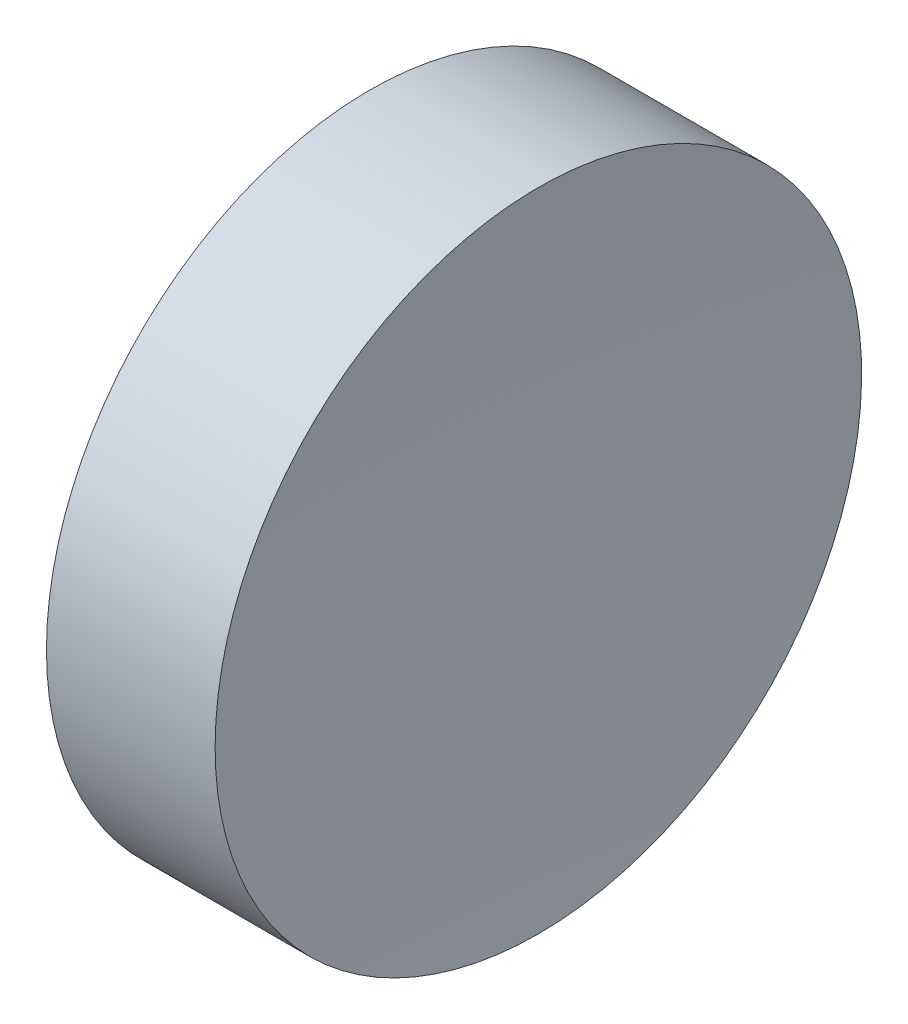
ISO-10303-21;
HEADER;
FILE_DESCRIPTION(('STEP AP214'),'2;1');
FILE_NAME('part.step','',(''),(''),'','','');
FILE_SCHEMA(('AUTOMOTIVE_DESIGN { 1 0 10303 214 1 1 1 1 }'));
ENDSEC;
DATA;
#1=APPLICATION_CONTEXT('core data for automotive mechanical design processes');
#2=APPLICATION_PROTOCOL_DEFINITION('international standard','automotive_design',2000,#1);
#3=PRODUCT_CONTEXT('',#1,'mechanical');
#4=PRODUCT('Part','Part','',(#3));
#5=PRODUCT_RELATED_PRODUCT_CATEGORY('part','',(#4));
#6=PRODUCT_DEFINITION_FORMATION('','',#4);
#7=PRODUCT_DEFINITION_CONTEXT('part definition',#1,'design');
#8=PRODUCT_DEFINITION('design','',#6,#7);
#9=PRODUCT_DEFINITION_SHAPE('','',#8);
#10=(LENGTH_UNIT() NAMED_UNIT(*) SI_UNIT(.MILLI.,.METRE.));
#11=(NAMED_UNIT(*) PLANE_ANGLE_UNIT() SI_UNIT($,.RADIAN.));
#12=(NAMED_UNIT(*) SI_UNIT($,.STERADIAN.) SOLID_ANGLE_UNIT());
#13=UNCERTAINTY_MEASURE_WITH_UNIT(LENGTH_MEASURE(1.E-05),#10,'distance_accuracy_value','');
#14=(GEOMETRIC_REPRESENTATION_CONTEXT(3) GLOBAL_UNCERTAINTY_ASSIGNED_CONTEXT((#13)) GLOBAL_UNIT_ASSIGNED_CONTEXT((#10,
#11,#12)) REPRESENTATION_CONTEXT('',''));
#15=CARTESIAN_POINT('',(0.,0.,0.));
#16=DIRECTION('',(0.,0.,1.));
#17=DIRECTION('',(1.,0.,0.));
#18=AXIS2_PLACEMENT_3D('',#15,#16,#17);
#19=CARTESIAN_POINT('',(271.092655759639,69.3780211233725,0.));
#20=DIRECTION('',(-1.,0.,0.));
#21=DIRECTION('',(0.,-1.,0.));
#22=AXIS2_PLACEMENT_3D('',#19,#20,#21);
#23=SPHERICAL_SURFACE('',#22,150.);
#24=CARTESIAN_POINT('',(121.614396470871,69.3780211233724,0.));
#25=DIRECTION('',(-1.,0.,0.));
#26=DIRECTION('',(0.,0.,1.));
#27=AXIS2_PLACEMENT_3D('',#24,#25,#26);
#28=CIRCLE('',#27,12.5);
#29=CARTESIAN_POINT('',(121.614396470871,69.3780211233724,12.5));
#30=VERTEX_POINT('',#29);
#31=EDGE_CURVE('E10',#30,#30,#28,.T.);
#32=ORIENTED_EDGE('',*,*,#31,.F.);
#33=EDGE_LOOP('',(#32));
#34=FACE_BOUND('',#33,.T.);
#35=ADVANCED_FACE('F35',(#34),#23,.F.);
#36=CARTESIAN_POINT('',(108.985143002165,69.3780211233724,0.));
#37=DIRECTION('',(-1.,0.,0.));
#38=DIRECTION('',(0.,0.,1.));
#39=AXIS2_PLACEMENT_3D('',#36,#37,#38);
#40=CYLINDRICAL_SURFACE('',#39,12.5);
#41=CARTESIAN_POINT('',(115.09265553492,69.3780211233724,0.));
#42=DIRECTION('',(-1.,0.,0.));
#43=DIRECTION('',(0.,0.,1.));
#44=AXIS2_PLACEMENT_3D('',#41,#42,#43);
#45=CIRCLE('',#44,12.5);
#46=CARTESIAN_POINT('',(115.09265553492,69.3780211233724,12.5));
#47=VERTEX_POINT('',#46);
#48=EDGE_CURVE('E41',#47,#47,#45,.T.);
#49=ORIENTED_EDGE('',*,*,#48,.F.);
#50=EDGE_LOOP('',(#49));
#51=FACE_BOUND('',#50,.T.);
#52=ORIENTED_EDGE('',*,*,#31,.T.);
#53=EDGE_LOOP('',(#52));
#54=FACE_BOUND('',#53,.T.);
#55=ADVANCED_FACE('F49',(#51,#54),#40,.T.);
#56=CARTESIAN_POINT('',(115.09265553492,69.3780211233724,0.));
#57=DIRECTION('',(1.,0.,0.));
#58=DIRECTION('',(0.,0.,-1.));
#59=AXIS2_PLACEMENT_3D('',#56,#57,#58);
#60=PLANE('',#59);
#61=ORIENTED_EDGE('',*,*,#48,.T.);
#62=EDGE_LOOP('',(#61));
#63=FACE_BOUND('',#62,.T.);
#64=ADVANCED_FACE('F47',(#63),#60,.F.);
#65=CLOSED_SHELL('',(#35,#55,#64));
#66=MANIFOLD_SOLID_BREP('B2',#65);
#67=ADVANCED_BREP_SHAPE_REPRESENTATION('',(#18,#66),#14);
#68=SHAPE_DEFINITION_REPRESENTATION(#9,#67);
ENDSEC;
END-ISO-10303-21;
